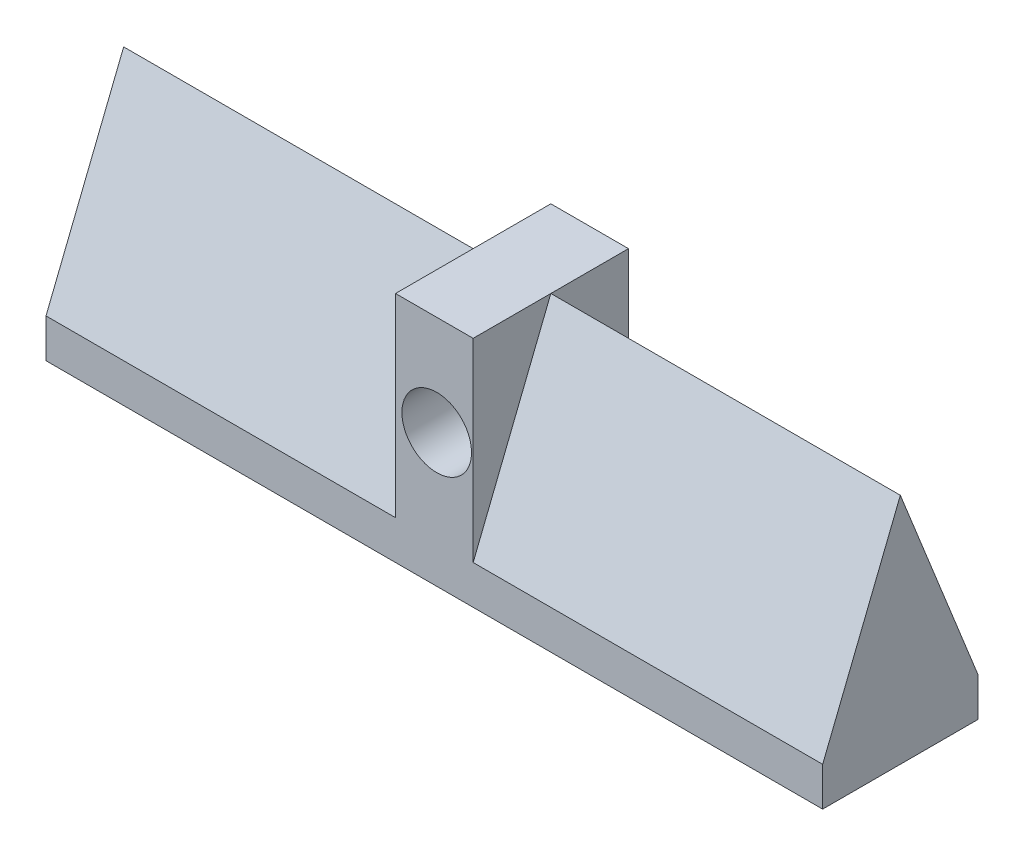
ISO-10303-21;
HEADER;
FILE_DESCRIPTION(('STEP AP214'),'2;1');
FILE_NAME('part.step','',(''),(''),'','','');
FILE_SCHEMA(('AUTOMOTIVE_DESIGN { 1 0 10303 214 1 1 1 1 }'));
ENDSEC;
DATA;
#1=APPLICATION_CONTEXT('core data for automotive mechanical design processes');
#2=APPLICATION_PROTOCOL_DEFINITION('international standard','automotive_design',2000,#1);
#3=PRODUCT_CONTEXT('',#1,'mechanical');
#4=PRODUCT('Part','Part','',(#3));
#5=PRODUCT_RELATED_PRODUCT_CATEGORY('part','',(#4));
#6=PRODUCT_DEFINITION_FORMATION('','',#4);
#7=PRODUCT_DEFINITION_CONTEXT('part definition',#1,'design');
#8=PRODUCT_DEFINITION('design','',#6,#7);
#9=PRODUCT_DEFINITION_SHAPE('','',#8);
#10=(LENGTH_UNIT() NAMED_UNIT(*) SI_UNIT(.MILLI.,.METRE.));
#11=(NAMED_UNIT(*) PLANE_ANGLE_UNIT() SI_UNIT($,.RADIAN.));
#12=(NAMED_UNIT(*) SI_UNIT($,.STERADIAN.) SOLID_ANGLE_UNIT());
#13=UNCERTAINTY_MEASURE_WITH_UNIT(LENGTH_MEASURE(1.E-05),#10,'distance_accuracy_value','');
#14=(GEOMETRIC_REPRESENTATION_CONTEXT(3) GLOBAL_UNCERTAINTY_ASSIGNED_CONTEXT((#13)) GLOBAL_UNIT_ASSIGNED_CONTEXT((#10,
#11,#12)) REPRESENTATION_CONTEXT('',''));
#15=CARTESIAN_POINT('',(0.,0.,0.));
#16=DIRECTION('',(0.,0.,1.));
#17=DIRECTION('',(1.,0.,0.));
#18=AXIS2_PLACEMENT_3D('',#15,#16,#17);
#19=CARTESIAN_POINT('',(1000.,50.,0.));
#20=DIRECTION('',(0.,-0.371390676354104,0.928476690885259));
#21=DIRECTION('',(0.,-0.928476690885259,-0.371390676354104));
#22=AXIS2_PLACEMENT_3D('',#19,#20,#21);
#23=PLANE('',#22);
#24=DIRECTION('',(-1.,0.,0.));
#25=VECTOR('',#24,1.);
#26=CARTESIAN_POINT('',(1000.,300.,100.));
#27=LINE('',#26,#25);
#28=CARTESIAN_POINT('',(450.,300.,100.));
#29=VERTEX_POINT('',#28);
#30=CARTESIAN_POINT('',(0.,300.,100.));
#31=VERTEX_POINT('',#30);
#32=EDGE_CURVE('E120',#29,#31,#27,.T.);
#33=ORIENTED_EDGE('',*,*,#32,.F.);
#34=DIRECTION('',(0.,-0.928476690885259,-0.371390676354104));
#35=VECTOR('',#34,1.);
#36=CARTESIAN_POINT('',(450.,50.,0.));
#37=LINE('',#36,#35);
#38=CARTESIAN_POINT('',(450.,50.,0.));
#39=VERTEX_POINT('',#38);
#40=EDGE_CURVE('E136',#29,#39,#37,.T.);
#41=ORIENTED_EDGE('',*,*,#40,.T.);
#42=DIRECTION('',(-1.,0.,0.));
#43=VECTOR('',#42,1.);
#44=CARTESIAN_POINT('',(1000.,50.,0.));
#45=LINE('',#44,#43);
#46=CARTESIAN_POINT('',(0.,50.,0.));
#47=VERTEX_POINT('',#46);
#48=EDGE_CURVE('E48',#39,#47,#45,.T.);
#49=ORIENTED_EDGE('',*,*,#48,.T.);
#50=DIRECTION('',(0.,0.928476690885259,0.371390676354104));
#51=VECTOR('',#50,1.);
#52=CARTESIAN_POINT('',(0.,50.,0.));
#53=LINE('',#52,#51);
#54=EDGE_CURVE('E135',#47,#31,#53,.T.);
#55=ORIENTED_EDGE('',*,*,#54,.T.);
#56=EDGE_LOOP('',(#33,#41,#49,#55));
#57=FACE_BOUND('',#56,.T.);
#58=ADVANCED_FACE('F39',(#57),#23,.F.);
#59=CARTESIAN_POINT('',(1000.,50.,200.));
#60=DIRECTION('',(0.,-0.371390676354104,-0.928476690885259));
#61=DIRECTION('',(0.,0.928476690885259,-0.371390676354104));
#62=AXIS2_PLACEMENT_3D('',#59,#60,#61);
#63=PLANE('',#62);
#64=DIRECTION('',(-1.,0.,0.));
#65=VECTOR('',#64,1.);
#66=CARTESIAN_POINT('',(1000.,50.,200.));
#67=LINE('',#66,#65);
#68=CARTESIAN_POINT('',(450.,50.,200.));
#69=VERTEX_POINT('',#68);
#70=CARTESIAN_POINT('',(0.,50.,200.));
#71=VERTEX_POINT('',#70);
#72=EDGE_CURVE('E121',#69,#71,#67,.T.);
#73=ORIENTED_EDGE('',*,*,#72,.F.);
#74=DIRECTION('',(0.,0.928476690885259,-0.371390676354104));
#75=VECTOR('',#74,1.);
#76=CARTESIAN_POINT('',(450.,50.,200.));
#77=LINE('',#76,#75);
#78=EDGE_CURVE('E166',#69,#29,#77,.T.);
#79=ORIENTED_EDGE('',*,*,#78,.T.);
#80=ORIENTED_EDGE('',*,*,#32,.T.);
#81=DIRECTION('',(0.,-0.928476690885259,0.371390676354104));
#82=VECTOR('',#81,1.);
#83=CARTESIAN_POINT('',(0.,50.,200.));
#84=LINE('',#83,#82);
#85=EDGE_CURVE('E140',#31,#71,#84,.T.);
#86=ORIENTED_EDGE('',*,*,#85,.T.);
#87=EDGE_LOOP('',(#73,#79,#80,#86));
#88=FACE_BOUND('',#87,.T.);
#89=ADVANCED_FACE('F163',(#88),#63,.F.);
#90=CARTESIAN_POINT('',(1000.,0.,0.));
#91=DIRECTION('',(0.,0.,1.));
#92=DIRECTION('',(1.,0.,0.));
#93=AXIS2_PLACEMENT_3D('',#90,#91,#92);
#94=PLANE('',#93);
#95=CARTESIAN_POINT('',(503.081055296905,171.556016761967,0.));
#96=DIRECTION('',(0.,0.,1.));
#97=DIRECTION('',(1.,0.,0.));
#98=AXIS2_PLACEMENT_3D('',#95,#96,#97);
#99=CIRCLE('',#98,44.8308402680044);
#100=CARTESIAN_POINT('',(547.911895564909,171.556016761967,0.));
#101=VERTEX_POINT('',#100);
#102=EDGE_CURVE('E215',#101,#101,#99,.T.);
#103=ORIENTED_EDGE('',*,*,#102,.T.);
#104=EDGE_LOOP('',(#103));
#105=FACE_BOUND('',#104,.T.);
#106=DIRECTION('',(-1.,0.,0.));
#107=VECTOR('',#106,1.);
#108=CARTESIAN_POINT('',(1000.,0.,0.));
#109=LINE('',#108,#107);
#110=CARTESIAN_POINT('',(1000.,0.,0.));
#111=VERTEX_POINT('',#110);
#112=CARTESIAN_POINT('',(0.,0.,0.));
#113=VERTEX_POINT('',#112);
#114=EDGE_CURVE('E87',#111,#113,#109,.T.);
#115=ORIENTED_EDGE('',*,*,#114,.T.);
#116=DIRECTION('',(0.,1.,0.));
#117=VECTOR('',#116,1.);
#118=CARTESIAN_POINT('',(0.,0.,0.));
#119=LINE('',#118,#117);
#120=EDGE_CURVE('E132',#113,#47,#119,.T.);
#121=ORIENTED_EDGE('',*,*,#120,.T.);
#122=ORIENTED_EDGE('',*,*,#48,.F.);
#123=DIRECTION('',(0.,1.,0.));
#124=VECTOR('',#123,1.);
#125=CARTESIAN_POINT('',(450.,0.,0.));
#126=LINE('',#125,#124);
#127=CARTESIAN_POINT('',(450.,300.,0.));
#128=VERTEX_POINT('',#127);
#129=EDGE_CURVE('E211',#39,#128,#126,.T.);
#130=ORIENTED_EDGE('',*,*,#129,.T.);
#131=DIRECTION('',(1.,0.,0.));
#132=VECTOR('',#131,1.);
#133=CARTESIAN_POINT('',(450.,300.,0.));
#134=LINE('',#133,#132);
#135=CARTESIAN_POINT('',(550.,300.,0.));
#136=VERTEX_POINT('',#135);
#137=EDGE_CURVE('E207',#128,#136,#134,.T.);
#138=ORIENTED_EDGE('',*,*,#137,.T.);
#139=DIRECTION('',(0.,-1.,0.));
#140=VECTOR('',#139,1.);
#141=CARTESIAN_POINT('',(550.,0.,0.));
#142=LINE('',#141,#140);
#143=CARTESIAN_POINT('',(550.,50.,0.));
#144=VERTEX_POINT('',#143);
#145=EDGE_CURVE('E204',#136,#144,#142,.T.);
#146=ORIENTED_EDGE('',*,*,#145,.T.);
#147=CARTESIAN_POINT('',(1000.,50.,0.));
#148=VERTEX_POINT('',#147);
#149=EDGE_CURVE('E11',#148,#144,#45,.T.);
#150=ORIENTED_EDGE('',*,*,#149,.F.);
#151=DIRECTION('',(0.,1.,0.));
#152=VECTOR('',#151,1.);
#153=CARTESIAN_POINT('',(1000.,0.,0.));
#154=LINE('',#153,#152);
#155=EDGE_CURVE('E150',#111,#148,#154,.T.);
#156=ORIENTED_EDGE('',*,*,#155,.F.);
#157=EDGE_LOOP('',(#115,#121,#122,#130,#138,#146,#150,#156));
#158=FACE_BOUND('',#157,.T.);
#159=ADVANCED_FACE('F41',(#105,#158),#94,.F.);
#160=ORIENTED_EDGE('',*,*,#149,.T.);
#161=DIRECTION('',(0.,0.928476690885259,0.371390676354104));
#162=VECTOR('',#161,1.);
#163=CARTESIAN_POINT('',(550.,50.,0.));
#164=LINE('',#163,#162);
#165=CARTESIAN_POINT('',(550.,300.,100.));
#166=VERTEX_POINT('',#165);
#167=EDGE_CURVE('E188',#144,#166,#164,.T.);
#168=ORIENTED_EDGE('',*,*,#167,.T.);
#169=CARTESIAN_POINT('',(1000.,300.,100.));
#170=VERTEX_POINT('',#169);
#171=EDGE_CURVE('E154',#170,#166,#27,.T.);
#172=ORIENTED_EDGE('',*,*,#171,.F.);
#173=DIRECTION('',(0.,0.928476690885259,0.371390676354104));
#174=VECTOR('',#173,1.);
#175=CARTESIAN_POINT('',(1000.,50.,0.));
#176=LINE('',#175,#174);
#177=EDGE_CURVE('E95',#148,#170,#176,.T.);
#178=ORIENTED_EDGE('',*,*,#177,.F.);
#179=EDGE_LOOP('',(#160,#168,#172,#178));
#180=FACE_BOUND('',#179,.T.);
#181=ADVANCED_FACE('F243',(#180),#23,.F.);
#182=ORIENTED_EDGE('',*,*,#171,.T.);
#183=DIRECTION('',(0.,-0.928476690885259,0.371390676354104));
#184=VECTOR('',#183,1.);
#185=CARTESIAN_POINT('',(550.,50.,200.));
#186=LINE('',#185,#184);
#187=CARTESIAN_POINT('',(550.,50.,200.));
#188=VERTEX_POINT('',#187);
#189=EDGE_CURVE('E117',#166,#188,#186,.T.);
#190=ORIENTED_EDGE('',*,*,#189,.T.);
#191=CARTESIAN_POINT('',(1000.,50.,200.));
#192=VERTEX_POINT('',#191);
#193=EDGE_CURVE('E113',#192,#188,#67,.T.);
#194=ORIENTED_EDGE('',*,*,#193,.F.);
#195=DIRECTION('',(0.,-0.928476690885259,0.371390676354104));
#196=VECTOR('',#195,1.);
#197=CARTESIAN_POINT('',(1000.,50.,200.));
#198=LINE('',#197,#196);
#199=EDGE_CURVE('E101',#170,#192,#198,.T.);
#200=ORIENTED_EDGE('',*,*,#199,.F.);
#201=EDGE_LOOP('',(#182,#190,#194,#200));
#202=FACE_BOUND('',#201,.T.);
#203=ADVANCED_FACE('F114',(#202),#63,.F.);
#204=CARTESIAN_POINT('',(1000.,0.,200.));
#205=DIRECTION('',(0.,0.,-1.));
#206=DIRECTION('',(-1.,0.,0.));
#207=AXIS2_PLACEMENT_3D('',#204,#205,#206);
#208=PLANE('',#207);
#209=CARTESIAN_POINT('',(503.081055296905,171.556016761967,200.));
#210=DIRECTION('',(0.,0.,-1.));
#211=DIRECTION('',(-1.,0.,0.));
#212=AXIS2_PLACEMENT_3D('',#209,#210,#211);
#213=CIRCLE('',#212,44.8308402680044);
#214=CARTESIAN_POINT('',(458.250215028901,171.556016761967,200.));
#215=VERTEX_POINT('',#214);
#216=EDGE_CURVE('E229',#215,#215,#213,.T.);
#217=ORIENTED_EDGE('',*,*,#216,.T.);
#218=EDGE_LOOP('',(#217));
#219=FACE_BOUND('',#218,.T.);
#220=ORIENTED_EDGE('',*,*,#193,.T.);
#221=DIRECTION('',(0.,-1.,0.));
#222=VECTOR('',#221,1.);
#223=CARTESIAN_POINT('',(550.,0.,200.));
#224=LINE('',#223,#222);
#225=CARTESIAN_POINT('',(550.,300.,200.));
#226=VERTEX_POINT('',#225);
#227=EDGE_CURVE('E216',#226,#188,#224,.T.);
#228=ORIENTED_EDGE('',*,*,#227,.F.);
#229=DIRECTION('',(1.,0.,0.));
#230=VECTOR('',#229,1.);
#231=CARTESIAN_POINT('',(450.,300.,200.));
#232=LINE('',#231,#230);
#233=CARTESIAN_POINT('',(450.,300.,200.));
#234=VERTEX_POINT('',#233);
#235=EDGE_CURVE('E220',#234,#226,#232,.T.);
#236=ORIENTED_EDGE('',*,*,#235,.F.);
#237=DIRECTION('',(0.,1.,0.));
#238=VECTOR('',#237,1.);
#239=CARTESIAN_POINT('',(450.,0.,200.));
#240=LINE('',#239,#238);
#241=EDGE_CURVE('E55',#69,#234,#240,.T.);
#242=ORIENTED_EDGE('',*,*,#241,.F.);
#243=ORIENTED_EDGE('',*,*,#72,.T.);
#244=DIRECTION('',(0.,-1.,0.));
#245=VECTOR('',#244,1.);
#246=CARTESIAN_POINT('',(0.,0.,200.));
#247=LINE('',#246,#245);
#248=CARTESIAN_POINT('',(0.,0.,200.));
#249=VERTEX_POINT('',#248);
#250=EDGE_CURVE('E144',#71,#249,#247,.T.);
#251=ORIENTED_EDGE('',*,*,#250,.T.);
#252=DIRECTION('',(-1.,0.,0.));
#253=VECTOR('',#252,1.);
#254=CARTESIAN_POINT('',(1000.,0.,200.));
#255=LINE('',#254,#253);
#256=CARTESIAN_POINT('',(1000.,0.,200.));
#257=VERTEX_POINT('',#256);
#258=EDGE_CURVE('E125',#257,#249,#255,.T.);
#259=ORIENTED_EDGE('',*,*,#258,.F.);
#260=DIRECTION('',(0.,-1.,0.));
#261=VECTOR('',#260,1.);
#262=CARTESIAN_POINT('',(1000.,0.,200.));
#263=LINE('',#262,#261);
#264=EDGE_CURVE('E105',#192,#257,#263,.T.);
#265=ORIENTED_EDGE('',*,*,#264,.F.);
#266=EDGE_LOOP('',(#220,#228,#236,#242,#243,#251,#259,#265));
#267=FACE_BOUND('',#266,.T.);
#268=ADVANCED_FACE('F123',(#219,#267),#208,.F.);
#269=CARTESIAN_POINT('',(1000.,0.,0.));
#270=DIRECTION('',(0.,1.,0.));
#271=DIRECTION('',(0.,0.,1.));
#272=AXIS2_PLACEMENT_3D('',#269,#270,#271);
#273=PLANE('',#272);
#274=ORIENTED_EDGE('',*,*,#258,.T.);
#275=DIRECTION('',(0.,0.,-1.));
#276=VECTOR('',#275,1.);
#277=CARTESIAN_POINT('',(0.,0.,0.));
#278=LINE('',#277,#276);
#279=EDGE_CURVE('E147',#249,#113,#278,.T.);
#280=ORIENTED_EDGE('',*,*,#279,.T.);
#281=ORIENTED_EDGE('',*,*,#114,.F.);
#282=DIRECTION('',(0.,0.,-1.));
#283=VECTOR('',#282,1.);
#284=CARTESIAN_POINT('',(1000.,0.,0.));
#285=LINE('',#284,#283);
#286=EDGE_CURVE('E64',#257,#111,#285,.T.);
#287=ORIENTED_EDGE('',*,*,#286,.F.);
#288=EDGE_LOOP('',(#274,#280,#281,#287));
#289=FACE_BOUND('',#288,.T.);
#290=ADVANCED_FACE('F177',(#289),#273,.F.);
#291=CARTESIAN_POINT('',(1000.,0.,0.));
#292=DIRECTION('',(1.,0.,0.));
#293=DIRECTION('',(0.,0.,-1.));
#294=AXIS2_PLACEMENT_3D('',#291,#292,#293);
#295=PLANE('',#294);
#296=ORIENTED_EDGE('',*,*,#155,.T.);
#297=ORIENTED_EDGE('',*,*,#177,.T.);
#298=ORIENTED_EDGE('',*,*,#199,.T.);
#299=ORIENTED_EDGE('',*,*,#264,.T.);
#300=ORIENTED_EDGE('',*,*,#286,.T.);
#301=EDGE_LOOP('',(#296,#297,#298,#299,#300));
#302=FACE_BOUND('',#301,.T.);
#303=ADVANCED_FACE('F103',(#302),#295,.T.);
#304=CARTESIAN_POINT('',(0.,0.,0.));
#305=DIRECTION('',(1.,0.,0.));
#306=DIRECTION('',(0.,0.,-1.));
#307=AXIS2_PLACEMENT_3D('',#304,#305,#306);
#308=PLANE('',#307);
#309=ORIENTED_EDGE('',*,*,#120,.F.);
#310=ORIENTED_EDGE('',*,*,#279,.F.);
#311=ORIENTED_EDGE('',*,*,#250,.F.);
#312=ORIENTED_EDGE('',*,*,#85,.F.);
#313=ORIENTED_EDGE('',*,*,#54,.F.);
#314=EDGE_LOOP('',(#309,#310,#311,#312,#313));
#315=FACE_BOUND('',#314,.T.);
#316=ADVANCED_FACE('F173',(#315),#308,.F.);
#317=CARTESIAN_POINT('',(450.,300.,200.));
#318=DIRECTION('',(0.,1.,0.));
#319=DIRECTION('',(-1.,0.,0.));
#320=AXIS2_PLACEMENT_3D('',#317,#318,#319);
#321=PLANE('',#320);
#322=DIRECTION('',(0.,0.,-1.));
#323=VECTOR('',#322,1.);
#324=CARTESIAN_POINT('',(550.,300.,200.));
#325=LINE('',#324,#323);
#326=EDGE_CURVE('E194',#226,#166,#325,.T.);
#327=ORIENTED_EDGE('',*,*,#326,.T.);
#328=EDGE_CURVE('E199',#166,#136,#325,.T.);
#329=ORIENTED_EDGE('',*,*,#328,.T.);
#330=ORIENTED_EDGE('',*,*,#137,.F.);
#331=DIRECTION('',(0.,0.,-1.));
#332=VECTOR('',#331,1.);
#333=CARTESIAN_POINT('',(450.,300.,200.));
#334=LINE('',#333,#332);
#335=EDGE_CURVE('E200',#29,#128,#334,.T.);
#336=ORIENTED_EDGE('',*,*,#335,.F.);
#337=EDGE_CURVE('E195',#234,#29,#334,.T.);
#338=ORIENTED_EDGE('',*,*,#337,.F.);
#339=ORIENTED_EDGE('',*,*,#235,.T.);
#340=EDGE_LOOP('',(#327,#329,#330,#336,#338,#339));
#341=FACE_BOUND('',#340,.T.);
#342=ADVANCED_FACE('F260',(#341),#321,.T.);
#343=CARTESIAN_POINT('',(450.,0.,200.));
#344=DIRECTION('',(-1.,0.,0.));
#345=DIRECTION('',(0.,0.,1.));
#346=AXIS2_PLACEMENT_3D('',#343,#344,#345);
#347=PLANE('',#346);
#348=ORIENTED_EDGE('',*,*,#40,.F.);
#349=ORIENTED_EDGE('',*,*,#335,.T.);
#350=ORIENTED_EDGE('',*,*,#129,.F.);
#351=EDGE_LOOP('',(#348,#349,#350));
#352=FACE_BOUND('',#351,.T.);
#353=ADVANCED_FACE('F263',(#352),#347,.T.);
#354=ORIENTED_EDGE('',*,*,#78,.F.);
#355=ORIENTED_EDGE('',*,*,#241,.T.);
#356=ORIENTED_EDGE('',*,*,#337,.T.);
#357=EDGE_LOOP('',(#354,#355,#356));
#358=FACE_BOUND('',#357,.T.);
#359=ADVANCED_FACE('F266',(#358),#347,.T.);
#360=CARTESIAN_POINT('',(550.,0.,200.));
#361=DIRECTION('',(1.,0.,0.));
#362=DIRECTION('',(0.,0.,-1.));
#363=AXIS2_PLACEMENT_3D('',#360,#361,#362);
#364=PLANE('',#363);
#365=ORIENTED_EDGE('',*,*,#167,.F.);
#366=ORIENTED_EDGE('',*,*,#145,.F.);
#367=ORIENTED_EDGE('',*,*,#328,.F.);
#368=EDGE_LOOP('',(#365,#366,#367));
#369=FACE_BOUND('',#368,.T.);
#370=ADVANCED_FACE('F271',(#369),#364,.T.);
#371=ORIENTED_EDGE('',*,*,#189,.F.);
#372=ORIENTED_EDGE('',*,*,#326,.F.);
#373=ORIENTED_EDGE('',*,*,#227,.T.);
#374=EDGE_LOOP('',(#371,#372,#373));
#375=FACE_BOUND('',#374,.T.);
#376=ADVANCED_FACE('F238',(#375),#364,.T.);
#377=CARTESIAN_POINT('',(503.081055296905,171.556016761967,200.));
#378=DIRECTION('',(0.,0.,-1.));
#379=DIRECTION('',(-1.,0.,0.));
#380=AXIS2_PLACEMENT_3D('',#377,#378,#379);
#381=CYLINDRICAL_SURFACE('',#380,44.8308402680044);
#382=ORIENTED_EDGE('',*,*,#216,.F.);
#383=EDGE_LOOP('',(#382));
#384=FACE_BOUND('',#383,.T.);
#385=ORIENTED_EDGE('',*,*,#102,.F.);
#386=EDGE_LOOP('',(#385));
#387=FACE_BOUND('',#386,.T.);
#388=ADVANCED_FACE('F235',(#384,#387),#381,.F.);
#389=CLOSED_SHELL('',(#58,#89,#159,#181,#203,#268,#290,#303,#316,#342,#353,#359,#370,#376,#388));
#390=MANIFOLD_SOLID_BREP('B2',#389);
#391=ADVANCED_BREP_SHAPE_REPRESENTATION('',(#18,#390),#14);
#392=SHAPE_DEFINITION_REPRESENTATION(#9,#391);
ENDSEC;
END-ISO-10303-21;
